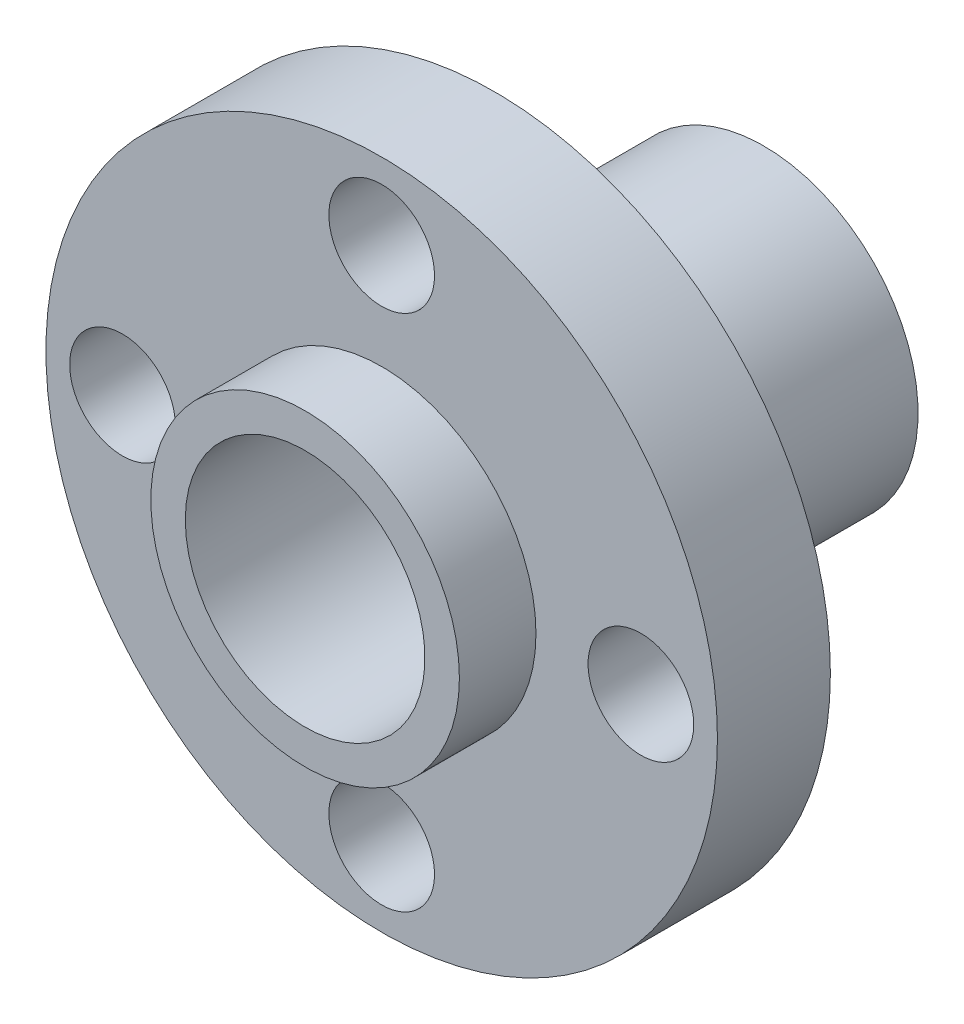
ISO-10303-21;
HEADER;
FILE_DESCRIPTION(('STEP AP214'),'2;1');
FILE_NAME('part.step','',(''),(''),'','','');
FILE_SCHEMA(('AUTOMOTIVE_DESIGN { 1 0 10303 214 1 1 1 1 }'));
ENDSEC;
DATA;
#1=APPLICATION_CONTEXT('core data for automotive mechanical design processes');
#2=APPLICATION_PROTOCOL_DEFINITION('international standard','automotive_design',2000,#1);
#3=PRODUCT_CONTEXT('',#1,'mechanical');
#4=PRODUCT('Part','Part','',(#3));
#5=PRODUCT_RELATED_PRODUCT_CATEGORY('part','',(#4));
#6=PRODUCT_DEFINITION_FORMATION('','',#4);
#7=PRODUCT_DEFINITION_CONTEXT('part definition',#1,'design');
#8=PRODUCT_DEFINITION('design','',#6,#7);
#9=PRODUCT_DEFINITION_SHAPE('','',#8);
#10=(LENGTH_UNIT() NAMED_UNIT(*) SI_UNIT(.MILLI.,.METRE.));
#11=(NAMED_UNIT(*) PLANE_ANGLE_UNIT() SI_UNIT($,.RADIAN.));
#12=(NAMED_UNIT(*) SI_UNIT($,.STERADIAN.) SOLID_ANGLE_UNIT());
#13=UNCERTAINTY_MEASURE_WITH_UNIT(LENGTH_MEASURE(1.E-05),#10,'distance_accuracy_value','');
#14=(GEOMETRIC_REPRESENTATION_CONTEXT(3) GLOBAL_UNCERTAINTY_ASSIGNED_CONTEXT((#13)) GLOBAL_UNIT_ASSIGNED_CONTEXT((#10,
#11,#12)) REPRESENTATION_CONTEXT('',''));
#15=CARTESIAN_POINT('',(0.,0.,0.));
#16=DIRECTION('',(0.,0.,1.));
#17=DIRECTION('',(1.,0.,0.));
#18=AXIS2_PLACEMENT_3D('',#15,#16,#17);
#19=CARTESIAN_POINT('',(0.,0.,3.7465));
#20=DIRECTION('',(0.,0.,-1.));
#21=DIRECTION('',(-1.,0.,0.));
#22=AXIS2_PLACEMENT_3D('',#19,#20,#21);
#23=CYLINDRICAL_SURFACE('',#22,11.1379);
#24=CARTESIAN_POINT('',(0.,0.,3.7465));
#25=DIRECTION('',(0.,0.,1.));
#26=DIRECTION('',(1.,0.,0.));
#27=AXIS2_PLACEMENT_3D('',#24,#25,#26);
#28=CIRCLE('',#27,11.1379);
#29=CARTESIAN_POINT('',(11.1379,0.,3.7465));
#30=VERTEX_POINT('',#29);
#31=EDGE_CURVE('E48',#30,#30,#28,.T.);
#32=ORIENTED_EDGE('',*,*,#31,.F.);
#33=EDGE_LOOP('',(#32));
#34=FACE_BOUND('',#33,.T.);
#35=CARTESIAN_POINT('',(0.,0.,0.));
#36=DIRECTION('',(0.,0.,1.));
#37=DIRECTION('',(1.,0.,0.));
#38=AXIS2_PLACEMENT_3D('',#35,#36,#37);
#39=CIRCLE('',#38,11.1379);
#40=CARTESIAN_POINT('',(11.1379,0.,0.));
#41=VERTEX_POINT('',#40);
#42=EDGE_CURVE('E56',#41,#41,#39,.T.);
#43=ORIENTED_EDGE('',*,*,#42,.T.);
#44=EDGE_LOOP('',(#43));
#45=FACE_BOUND('',#44,.T.);
#46=ADVANCED_FACE('F36',(#34,#45),#23,.T.);
#47=CARTESIAN_POINT('',(0.,0.,3.7465));
#48=DIRECTION('',(0.,0.,1.));
#49=DIRECTION('',(1.,0.,0.));
#50=AXIS2_PLACEMENT_3D('',#47,#48,#49);
#51=PLANE('',#50);
#52=CARTESIAN_POINT('',(0.,8.5979,3.7465));
#53=DIRECTION('',(0.,0.,1.));
#54=DIRECTION('',(1.,0.,0.));
#55=AXIS2_PLACEMENT_3D('',#52,#53,#54);
#56=CIRCLE('',#55,1.7526);
#57=CARTESIAN_POINT('',(1.7526,8.5979,3.7465));
#58=VERTEX_POINT('',#57);
#59=EDGE_CURVE('E66',#58,#58,#56,.T.);
#60=ORIENTED_EDGE('',*,*,#59,.F.);
#61=EDGE_LOOP('',(#60));
#62=FACE_BOUND('',#61,.T.);
#63=CARTESIAN_POINT('',(8.5979,0.,3.7465));
#64=DIRECTION('',(0.,0.,1.));
#65=DIRECTION('',(1.,0.,0.));
#66=AXIS2_PLACEMENT_3D('',#63,#64,#65);
#67=CIRCLE('',#66,1.7526);
#68=CARTESIAN_POINT('',(10.3505,0.,3.7465));
#69=VERTEX_POINT('',#68);
#70=EDGE_CURVE('E89',#69,#69,#67,.T.);
#71=ORIENTED_EDGE('',*,*,#70,.F.);
#72=EDGE_LOOP('',(#71));
#73=FACE_BOUND('',#72,.T.);
#74=CARTESIAN_POINT('',(0.,-8.5979,3.7465));
#75=DIRECTION('',(0.,0.,1.));
#76=DIRECTION('',(1.,0.,0.));
#77=AXIS2_PLACEMENT_3D('',#74,#75,#76);
#78=CIRCLE('',#77,1.7526);
#79=CARTESIAN_POINT('',(1.75259999999994,-8.5979,3.7465));
#80=VERTEX_POINT('',#79);
#81=EDGE_CURVE('E86',#80,#80,#78,.T.);
#82=ORIENTED_EDGE('',*,*,#81,.F.);
#83=EDGE_LOOP('',(#82));
#84=FACE_BOUND('',#83,.T.);
#85=CARTESIAN_POINT('',(-8.5979,0.,3.7465));
#86=DIRECTION('',(0.,0.,1.));
#87=DIRECTION('',(1.,0.,0.));
#88=AXIS2_PLACEMENT_3D('',#85,#86,#87);
#89=CIRCLE('',#88,1.7526);
#90=CARTESIAN_POINT('',(-6.8453,0.,3.7465));
#91=VERTEX_POINT('',#90);
#92=EDGE_CURVE('E83',#91,#91,#89,.T.);
#93=ORIENTED_EDGE('',*,*,#92,.F.);
#94=EDGE_LOOP('',(#93));
#95=FACE_BOUND('',#94,.T.);
#96=CARTESIAN_POINT('',(0.,0.,3.7465));
#97=DIRECTION('',(0.,0.,1.));
#98=DIRECTION('',(1.,0.,0.));
#99=AXIS2_PLACEMENT_3D('',#96,#97,#98);
#100=CIRCLE('',#99,5.1181);
#101=CARTESIAN_POINT('',(5.1181,0.,3.7465));
#102=VERTEX_POINT('',#101);
#103=EDGE_CURVE('E10',#102,#102,#100,.T.);
#104=ORIENTED_EDGE('',*,*,#103,.F.);
#105=EDGE_LOOP('',(#104));
#106=FACE_BOUND('',#105,.T.);
#107=ORIENTED_EDGE('',*,*,#31,.T.);
#108=EDGE_LOOP('',(#107));
#109=FACE_BOUND('',#108,.T.);
#110=ADVANCED_FACE('F98',(#62,#73,#84,#95,#106,#109),#51,.T.);
#111=CARTESIAN_POINT('',(0.,0.,0.));
#112=DIRECTION('',(0.,0.,1.));
#113=DIRECTION('',(1.,0.,0.));
#114=AXIS2_PLACEMENT_3D('',#111,#112,#113);
#115=PLANE('',#114);
#116=CARTESIAN_POINT('',(0.,8.5979,0.));
#117=DIRECTION('',(0.,0.,1.));
#118=DIRECTION('',(1.,0.,0.));
#119=AXIS2_PLACEMENT_3D('',#116,#117,#118);
#120=CIRCLE('',#119,1.7526);
#121=CARTESIAN_POINT('',(1.7526,8.5979,0.));
#122=VERTEX_POINT('',#121);
#123=EDGE_CURVE('E39',#122,#122,#120,.T.);
#124=ORIENTED_EDGE('',*,*,#123,.T.);
#125=EDGE_LOOP('',(#124));
#126=FACE_BOUND('',#125,.T.);
#127=CARTESIAN_POINT('',(8.5979,0.,0.));
#128=DIRECTION('',(0.,0.,1.));
#129=DIRECTION('',(1.,0.,0.));
#130=AXIS2_PLACEMENT_3D('',#127,#128,#129);
#131=CIRCLE('',#130,1.7526);
#132=CARTESIAN_POINT('',(10.3505,0.,0.));
#133=VERTEX_POINT('',#132);
#134=EDGE_CURVE('E68',#133,#133,#131,.T.);
#135=ORIENTED_EDGE('',*,*,#134,.T.);
#136=EDGE_LOOP('',(#135));
#137=FACE_BOUND('',#136,.T.);
#138=CARTESIAN_POINT('',(0.,-8.5979,0.));
#139=DIRECTION('',(0.,0.,1.));
#140=DIRECTION('',(1.,0.,0.));
#141=AXIS2_PLACEMENT_3D('',#138,#139,#140);
#142=CIRCLE('',#141,1.7526);
#143=CARTESIAN_POINT('',(1.75259999999994,-8.5979,0.));
#144=VERTEX_POINT('',#143);
#145=EDGE_CURVE('E65',#144,#144,#142,.T.);
#146=ORIENTED_EDGE('',*,*,#145,.T.);
#147=EDGE_LOOP('',(#146));
#148=FACE_BOUND('',#147,.T.);
#149=CARTESIAN_POINT('',(-8.5979,0.,0.));
#150=DIRECTION('',(0.,0.,1.));
#151=DIRECTION('',(1.,0.,0.));
#152=AXIS2_PLACEMENT_3D('',#149,#150,#151);
#153=CIRCLE('',#152,1.7526);
#154=CARTESIAN_POINT('',(-6.8453,0.,0.));
#155=VERTEX_POINT('',#154);
#156=EDGE_CURVE('E62',#155,#155,#153,.T.);
#157=ORIENTED_EDGE('',*,*,#156,.T.);
#158=EDGE_LOOP('',(#157));
#159=FACE_BOUND('',#158,.T.);
#160=CARTESIAN_POINT('',(0.,0.,0.));
#161=DIRECTION('',(0.,0.,-1.));
#162=DIRECTION('',(-1.,0.,0.));
#163=AXIS2_PLACEMENT_3D('',#160,#161,#162);
#164=CIRCLE('',#163,5.1181);
#165=CARTESIAN_POINT('',(-5.1181,0.,0.));
#166=VERTEX_POINT('',#165);
#167=EDGE_CURVE('E43',#166,#166,#164,.T.);
#168=ORIENTED_EDGE('',*,*,#167,.F.);
#169=EDGE_LOOP('',(#168));
#170=FACE_BOUND('',#169,.T.);
#171=ORIENTED_EDGE('',*,*,#42,.F.);
#172=EDGE_LOOP('',(#171));
#173=FACE_BOUND('',#172,.T.);
#174=ADVANCED_FACE('F101',(#126,#137,#148,#159,#170,#173),#115,.F.);
#175=CARTESIAN_POINT('',(0.,0.,-8.9281));
#176=DIRECTION('',(0.,0.,1.));
#177=DIRECTION('',(1.,0.,0.));
#178=AXIS2_PLACEMENT_3D('',#175,#176,#177);
#179=CYLINDRICAL_SURFACE('',#178,5.1181);
#180=CARTESIAN_POINT('',(0.,0.,-8.9281));
#181=DIRECTION('',(0.,0.,-1.));
#182=DIRECTION('',(-1.,0.,0.));
#183=AXIS2_PLACEMENT_3D('',#180,#181,#182);
#184=CIRCLE('',#183,5.1181);
#185=CARTESIAN_POINT('',(-5.1181,0.,-8.9281));
#186=VERTEX_POINT('',#185);
#187=EDGE_CURVE('E54',#186,#186,#184,.T.);
#188=ORIENTED_EDGE('',*,*,#187,.F.);
#189=EDGE_LOOP('',(#188));
#190=FACE_BOUND('',#189,.T.);
#191=ORIENTED_EDGE('',*,*,#167,.T.);
#192=EDGE_LOOP('',(#191));
#193=FACE_BOUND('',#192,.T.);
#194=ADVANCED_FACE('F117',(#190,#193),#179,.T.);
#195=CARTESIAN_POINT('',(0.,0.,-8.9281));
#196=DIRECTION('',(0.,0.,-1.));
#197=DIRECTION('',(-1.,0.,0.));
#198=AXIS2_PLACEMENT_3D('',#195,#196,#197);
#199=PLANE('',#198);
#200=CARTESIAN_POINT('',(0.,0.,-8.9281));
#201=DIRECTION('',(0.,0.,-1.));
#202=DIRECTION('',(-1.,0.,0.));
#203=AXIS2_PLACEMENT_3D('',#200,#201,#202);
#204=CIRCLE('',#203,3.9751);
#205=CARTESIAN_POINT('',(-3.9751,0.,-8.9281));
#206=VERTEX_POINT('',#205);
#207=EDGE_CURVE('E73',#206,#206,#204,.T.);
#208=ORIENTED_EDGE('',*,*,#207,.F.);
#209=EDGE_LOOP('',(#208));
#210=FACE_BOUND('',#209,.T.);
#211=ORIENTED_EDGE('',*,*,#187,.T.);
#212=EDGE_LOOP('',(#211));
#213=FACE_BOUND('',#212,.T.);
#214=ADVANCED_FACE('F121',(#210,#213),#199,.T.);
#215=CARTESIAN_POINT('',(0.,0.,6.2865));
#216=DIRECTION('',(0.,0.,-1.));
#217=DIRECTION('',(-1.,0.,0.));
#218=AXIS2_PLACEMENT_3D('',#215,#216,#217);
#219=CYLINDRICAL_SURFACE('',#218,5.1181);
#220=CARTESIAN_POINT('',(0.,0.,6.2865));
#221=DIRECTION('',(0.,0.,1.));
#222=DIRECTION('',(1.,0.,0.));
#223=AXIS2_PLACEMENT_3D('',#220,#221,#222);
#224=CIRCLE('',#223,5.1181);
#225=CARTESIAN_POINT('',(5.1181,0.,6.2865));
#226=VERTEX_POINT('',#225);
#227=EDGE_CURVE('E52',#226,#226,#224,.T.);
#228=ORIENTED_EDGE('',*,*,#227,.F.);
#229=EDGE_LOOP('',(#228));
#230=FACE_BOUND('',#229,.T.);
#231=ORIENTED_EDGE('',*,*,#103,.T.);
#232=EDGE_LOOP('',(#231));
#233=FACE_BOUND('',#232,.T.);
#234=ADVANCED_FACE('F127',(#230,#233),#219,.T.);
#235=CARTESIAN_POINT('',(0.,0.,6.2865));
#236=DIRECTION('',(0.,0.,1.));
#237=DIRECTION('',(1.,0.,0.));
#238=AXIS2_PLACEMENT_3D('',#235,#236,#237);
#239=PLANE('',#238);
#240=CARTESIAN_POINT('',(0.,0.,6.2865));
#241=DIRECTION('',(0.,0.,-1.));
#242=DIRECTION('',(-1.,0.,0.));
#243=AXIS2_PLACEMENT_3D('',#240,#241,#242);
#244=CIRCLE('',#243,3.9751);
#245=CARTESIAN_POINT('',(-3.9751,0.,6.2865));
#246=VERTEX_POINT('',#245);
#247=EDGE_CURVE('E77',#246,#246,#244,.T.);
#248=ORIENTED_EDGE('',*,*,#247,.T.);
#249=EDGE_LOOP('',(#248));
#250=FACE_BOUND('',#249,.T.);
#251=ORIENTED_EDGE('',*,*,#227,.T.);
#252=EDGE_LOOP('',(#251));
#253=FACE_BOUND('',#252,.T.);
#254=ADVANCED_FACE('F131',(#250,#253),#239,.T.);
#255=CARTESIAN_POINT('',(0.,0.,6.2865));
#256=DIRECTION('',(0.,0.,-1.));
#257=DIRECTION('',(-1.,0.,0.));
#258=AXIS2_PLACEMENT_3D('',#255,#256,#257);
#259=CYLINDRICAL_SURFACE('',#258,3.9751);
#260=ORIENTED_EDGE('',*,*,#247,.F.);
#261=EDGE_LOOP('',(#260));
#262=FACE_BOUND('',#261,.T.);
#263=ORIENTED_EDGE('',*,*,#207,.T.);
#264=EDGE_LOOP('',(#263));
#265=FACE_BOUND('',#264,.T.);
#266=ADVANCED_FACE('F135',(#262,#265),#259,.F.);
#267=CARTESIAN_POINT('',(-8.5979,0.,-8.9281));
#268=DIRECTION('',(0.,0.,1.));
#269=DIRECTION('',(1.,0.,0.));
#270=AXIS2_PLACEMENT_3D('',#267,#268,#269);
#271=CYLINDRICAL_SURFACE('',#270,1.7526);
#272=ORIENTED_EDGE('',*,*,#92,.T.);
#273=EDGE_LOOP('',(#272));
#274=FACE_BOUND('',#273,.T.);
#275=ORIENTED_EDGE('',*,*,#156,.F.);
#276=EDGE_LOOP('',(#275));
#277=FACE_BOUND('',#276,.T.);
#278=ADVANCED_FACE('F139',(#274,#277),#271,.F.);
#279=CARTESIAN_POINT('',(0.,-8.5979,-8.9281));
#280=DIRECTION('',(0.,0.,1.));
#281=DIRECTION('',(1.,0.,0.));
#282=AXIS2_PLACEMENT_3D('',#279,#280,#281);
#283=CYLINDRICAL_SURFACE('',#282,1.7526);
#284=ORIENTED_EDGE('',*,*,#81,.T.);
#285=EDGE_LOOP('',(#284));
#286=FACE_BOUND('',#285,.T.);
#287=ORIENTED_EDGE('',*,*,#145,.F.);
#288=EDGE_LOOP('',(#287));
#289=FACE_BOUND('',#288,.T.);
#290=ADVANCED_FACE('F143',(#286,#289),#283,.F.);
#291=CARTESIAN_POINT('',(8.5979,0.,-8.9281));
#292=DIRECTION('',(0.,0.,1.));
#293=DIRECTION('',(1.,0.,0.));
#294=AXIS2_PLACEMENT_3D('',#291,#292,#293);
#295=CYLINDRICAL_SURFACE('',#294,1.7526);
#296=ORIENTED_EDGE('',*,*,#70,.T.);
#297=EDGE_LOOP('',(#296));
#298=FACE_BOUND('',#297,.T.);
#299=ORIENTED_EDGE('',*,*,#134,.F.);
#300=EDGE_LOOP('',(#299));
#301=FACE_BOUND('',#300,.T.);
#302=ADVANCED_FACE('F147',(#298,#301),#295,.F.);
#303=CARTESIAN_POINT('',(0.,8.5979,-8.9281));
#304=DIRECTION('',(0.,0.,1.));
#305=DIRECTION('',(1.,0.,0.));
#306=AXIS2_PLACEMENT_3D('',#303,#304,#305);
#307=CYLINDRICAL_SURFACE('',#306,1.7526);
#308=ORIENTED_EDGE('',*,*,#59,.T.);
#309=EDGE_LOOP('',(#308));
#310=FACE_BOUND('',#309,.T.);
#311=ORIENTED_EDGE('',*,*,#123,.F.);
#312=EDGE_LOOP('',(#311));
#313=FACE_BOUND('',#312,.T.);
#314=ADVANCED_FACE('F95',(#310,#313),#307,.F.);
#315=CLOSED_SHELL('',(#46,#110,#174,#194,#214,#234,#254,#266,#278,#290,#302,#314));
#316=MANIFOLD_SOLID_BREP('B2',#315);
#317=ADVANCED_BREP_SHAPE_REPRESENTATION('',(#18,#316),#14);
#318=SHAPE_DEFINITION_REPRESENTATION(#9,#317);
ENDSEC;
END-ISO-10303-21;
